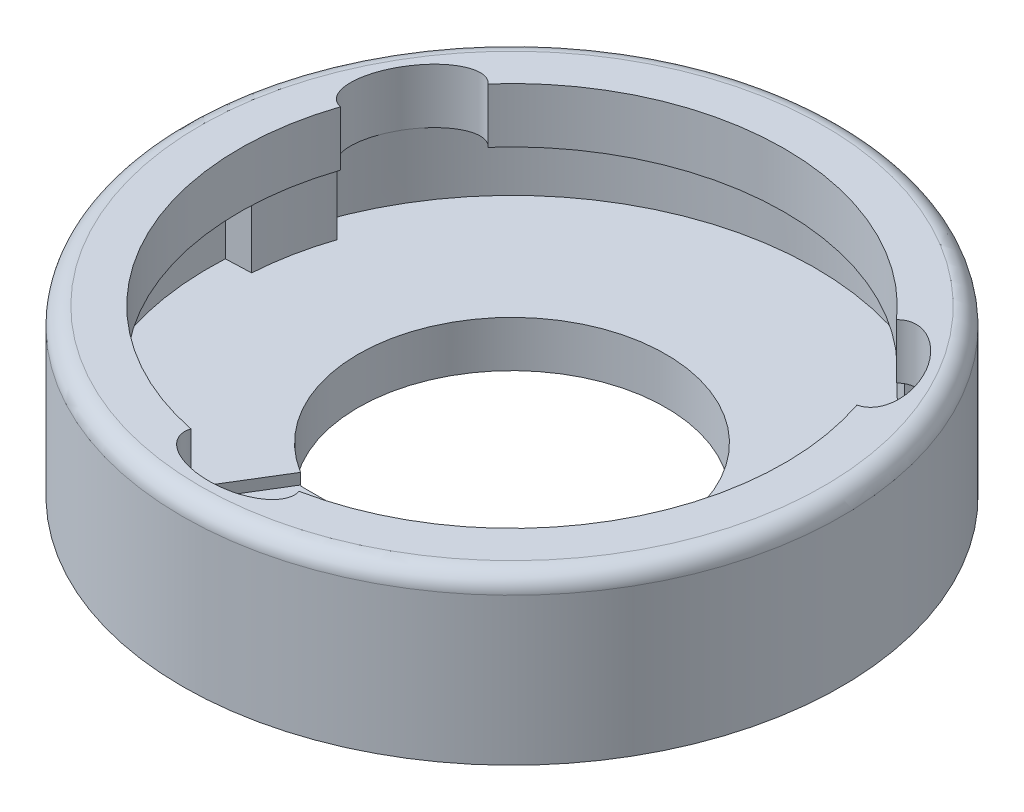
ISO-10303-21;
HEADER;
FILE_DESCRIPTION(('STEP AP214'),'2;1');
FILE_NAME('part.step','',(''),(''),'','','');
FILE_SCHEMA(('AUTOMOTIVE_DESIGN { 1 0 10303 214 1 1 1 1 }'));
ENDSEC;
DATA;
#1=APPLICATION_CONTEXT('core data for automotive mechanical design processes');
#2=APPLICATION_PROTOCOL_DEFINITION('international standard','automotive_design',2000,#1);
#3=PRODUCT_CONTEXT('',#1,'mechanical');
#4=PRODUCT('Part','Part','',(#3));
#5=PRODUCT_RELATED_PRODUCT_CATEGORY('part','',(#4));
#6=PRODUCT_DEFINITION_FORMATION('','',#4);
#7=PRODUCT_DEFINITION_CONTEXT('part definition',#1,'design');
#8=PRODUCT_DEFINITION('design','',#6,#7);
#9=PRODUCT_DEFINITION_SHAPE('','',#8);
#10=(LENGTH_UNIT() NAMED_UNIT(*) SI_UNIT(.MILLI.,.METRE.));
#11=(NAMED_UNIT(*) PLANE_ANGLE_UNIT() SI_UNIT($,.RADIAN.));
#12=(NAMED_UNIT(*) SI_UNIT($,.STERADIAN.) SOLID_ANGLE_UNIT());
#13=UNCERTAINTY_MEASURE_WITH_UNIT(LENGTH_MEASURE(1.E-05),#10,'distance_accuracy_value','');
#14=(GEOMETRIC_REPRESENTATION_CONTEXT(3) GLOBAL_UNCERTAINTY_ASSIGNED_CONTEXT((#13)) GLOBAL_UNIT_ASSIGNED_CONTEXT((#10,
#11,#12)) REPRESENTATION_CONTEXT('',''));
#15=CARTESIAN_POINT('',(0.,0.,0.));
#16=DIRECTION('',(0.,0.,1.));
#17=DIRECTION('',(1.,0.,0.));
#18=AXIS2_PLACEMENT_3D('',#15,#16,#17);
#19=CARTESIAN_POINT('',(0.,2.5,0.));
#20=DIRECTION('',(0.,-1.,0.));
#21=DIRECTION('',(0.,0.,-1.));
#22=AXIS2_PLACEMENT_3D('',#19,#20,#21);
#23=CYLINDRICAL_SURFACE('',#22,6.9);
#24=CARTESIAN_POINT('',(0.,1.05,0.));
#25=DIRECTION('',(0.,1.,0.));
#26=DIRECTION('',(0.,0.,-1.));
#27=AXIS2_PLACEMENT_3D('',#24,#25,#26);
#28=CIRCLE('',#27,6.9);
#29=CARTESIAN_POINT('',(-6.89026458179625,1.05,-0.36640686789977));
#30=VERTEX_POINT('',#29);
#31=CARTESIAN_POINT('',(-3.60125051882883,1.05,5.88566009047711));
#32=VERTEX_POINT('',#31);
#33=EDGE_CURVE('E700',#30,#32,#28,.T.);
#34=ORIENTED_EDGE('',*,*,#33,.F.);
#35=DIRECTION('',(0.,-1.,0.));
#36=VECTOR('',#35,1.);
#37=CARTESIAN_POINT('',(-6.89026458179625,2.5,-0.36640686789977));
#38=LINE('',#37,#36);
#39=CARTESIAN_POINT('',(-6.89026458179625,2.5,-0.36640686789977));
#40=VERTEX_POINT('',#39);
#41=EDGE_CURVE('E737',#30,#40,#38,.F.);
#42=ORIENTED_EDGE('',*,*,#41,.T.);
#43=CARTESIAN_POINT('',(0.,2.5,0.));
#44=DIRECTION('',(0.,1.,0.));
#45=DIRECTION('',(0.,0.,1.));
#46=AXIS2_PLACEMENT_3D('',#43,#44,#45);
#47=CIRCLE('',#46,6.9);
#48=CARTESIAN_POINT('',(0.,2.5,6.9));
#49=VERTEX_POINT('',#48);
#50=EDGE_CURVE('E302',#40,#49,#47,.T.);
#51=ORIENTED_EDGE('',*,*,#50,.T.);
#52=CARTESIAN_POINT('',(1.41322699134293,2.5,6.75372411865778));
#53=VERTEX_POINT('',#52);
#54=EDGE_CURVE('E233',#49,#53,#47,.T.);
#55=ORIENTED_EDGE('',*,*,#54,.T.);
#56=DIRECTION('',(0.,-1.,0.));
#57=VECTOR('',#56,1.);
#58=CARTESIAN_POINT('',(1.41322699134293,2.5,6.75372411865778));
#59=LINE('',#58,#57);
#60=CARTESIAN_POINT('',(1.41322699134293,0.8,6.75372411865778));
#61=VERTEX_POINT('',#60);
#62=EDGE_CURVE('E327',#53,#61,#59,.T.);
#63=ORIENTED_EDGE('',*,*,#62,.T.);
#64=CARTESIAN_POINT('',(0.,0.8,0.));
#65=DIRECTION('',(0.,1.,0.));
#66=DIRECTION('',(0.,0.,1.));
#67=AXIS2_PLACEMENT_3D('',#64,#65,#66);
#68=CIRCLE('',#67,6.9);
#69=CARTESIAN_POINT('',(-3.60125051882883,0.8,5.88566009047711));
#70=VERTEX_POINT('',#69);
#71=EDGE_CURVE('E236',#61,#70,#68,.F.);
#72=ORIENTED_EDGE('',*,*,#71,.T.);
#73=DIRECTION('',(0.,-1.,0.));
#74=VECTOR('',#73,1.);
#75=CARTESIAN_POINT('',(-3.60125051882883,1.05,5.88566009047711));
#76=LINE('',#75,#74);
#77=EDGE_CURVE('E686',#32,#70,#76,.T.);
#78=ORIENTED_EDGE('',*,*,#77,.F.);
#79=EDGE_LOOP('',(#34,#42,#51,#55,#63,#72,#78));
#80=FACE_BOUND('',#79,.T.);
#81=ADVANCED_FACE('F33',(#80),#23,.F.);
#82=CARTESIAN_POINT('',(-5.97557528611261,2.5,-3.45000000000003));
#83=VERTEX_POINT('',#82);
#84=CARTESIAN_POINT('',(-6.55551015258079,2.5,-2.152971583512));
#85=VERTEX_POINT('',#84);
#86=EDGE_CURVE('E767',#83,#85,#47,.T.);
#87=ORIENTED_EDGE('',*,*,#86,.T.);
#88=DIRECTION('',(0.,-1.,0.));
#89=VECTOR('',#88,1.);
#90=CARTESIAN_POINT('',(-6.55551015258079,2.5,-2.152971583512));
#91=LINE('',#90,#89);
#92=CARTESIAN_POINT('',(-6.55551015258079,1.05,-2.152971583512));
#93=VERTEX_POINT('',#92);
#94=EDGE_CURVE('E741',#85,#93,#91,.T.);
#95=ORIENTED_EDGE('',*,*,#94,.T.);
#96=CARTESIAN_POINT('',(3.76244994662044,1.05,-5.78394073268182));
#97=VERTEX_POINT('',#96);
#98=EDGE_CURVE('E699',#97,#93,#28,.T.);
#99=ORIENTED_EDGE('',*,*,#98,.F.);
#100=DIRECTION('',(0.,-1.,0.));
#101=VECTOR('',#100,1.);
#102=CARTESIAN_POINT('',(3.76244994662044,2.5,-5.78394073268181));
#103=LINE('',#102,#101);
#104=CARTESIAN_POINT('',(3.76244994662044,2.5,-5.78394073268181));
#105=VERTEX_POINT('',#104);
#106=EDGE_CURVE('E712',#97,#105,#103,.F.);
#107=ORIENTED_EDGE('',*,*,#106,.T.);
#108=EDGE_CURVE('E773',#105,#83,#47,.T.);
#109=ORIENTED_EDGE('',*,*,#108,.T.);
#110=EDGE_LOOP('',(#87,#95,#99,#107,#109));
#111=FACE_BOUND('',#110,.T.);
#112=ADVANCED_FACE('F350',(#111),#23,.F.);
#113=CARTESIAN_POINT('',(0.,1.05,0.));
#114=DIRECTION('',(0.,-1.,0.));
#115=DIRECTION('',(0.,0.,-1.));
#116=AXIS2_PLACEMENT_3D('',#113,#114,#115);
#117=PLANE('',#116);
#118=DIRECTION('',(0.999294785081363,0.,-0.0375490680202798));
#119=VECTOR('',#118,1.);
#120=CARTESIAN_POINT('',(-0.0234633419231046,1.05,-0.624430817075834));
#121=LINE('',#120,#119);
#122=CARTESIAN_POINT('',(-6.31283416335564,1.05,-0.388104143201012));
#123=VERTEX_POINT('',#122);
#124=EDGE_CURVE('E739',#30,#123,#121,.T.);
#125=ORIENTED_EDGE('',*,*,#124,.F.);
#126=ORIENTED_EDGE('',*,*,#33,.T.);
#127=DIRECTION('',(0.521920365047657,0.,-0.852994216011176));
#128=VECTOR('',#127,1.);
#129=CARTESIAN_POINT('',(-1.8267212776668,1.05,2.98547975603912));
#130=LINE('',#129,#128);
#131=CARTESIAN_POINT('',(-1.8267212776668,1.05,2.98547975603912));
#132=VERTEX_POINT('',#131);
#133=EDGE_CURVE('E689',#32,#132,#130,.T.);
#134=ORIENTED_EDGE('',*,*,#133,.T.);
#135=CARTESIAN_POINT('',(0.,1.05,0.));
#136=DIRECTION('',(0.,-1.,0.));
#137=DIRECTION('',(0.,0.,-1.));
#138=AXIS2_PLACEMENT_3D('',#135,#136,#137);
#139=CIRCLE('',#138,3.5);
#140=CARTESIAN_POINT('',(1.8267212776668,1.05,2.98547975603912));
#141=VERTEX_POINT('',#140);
#142=EDGE_CURVE('E692',#132,#141,#139,.T.);
#143=ORIENTED_EDGE('',*,*,#142,.T.);
#144=DIRECTION('',(0.521920365047657,0.,0.852994216011176));
#145=VECTOR('',#144,1.);
#146=CARTESIAN_POINT('',(1.8267212776668,1.05,2.98547975603912));
#147=LINE('',#146,#145);
#148=CARTESIAN_POINT('',(3.60125051882883,1.05,5.88566009047712));
#149=VERTEX_POINT('',#148);
#150=EDGE_CURVE('E701',#141,#149,#147,.T.);
#151=ORIENTED_EDGE('',*,*,#150,.T.);
#152=CARTESIAN_POINT('',(5.14228316123782,1.05,-4.60075253514574));
#153=VERTEX_POINT('',#152);
#154=EDGE_CURVE('E697',#149,#153,#28,.T.);
#155=ORIENTED_EDGE('',*,*,#154,.T.);
#156=DIRECTION('',(0.689310058131306,0.,-0.724466454543628));
#157=VECTOR('',#156,1.);
#158=CARTESIAN_POINT('',(0.401402703413376,1.05,0.381923716534586));
#159=LINE('',#158,#157);
#160=CARTESIAN_POINT('',(4.7443575034635,1.05,-4.18253175473057));
#161=VERTEX_POINT('',#160);
#162=EDGE_CURVE('E721',#161,#153,#159,.T.);
#163=ORIENTED_EDGE('',*,*,#162,.F.);
#164=CARTESIAN_POINT('',(0.,1.05,0.));
#165=DIRECTION('',(0.,-1.,0.));
#166=DIRECTION('',(0.,0.,-1.));
#167=AXIS2_PLACEMENT_3D('',#164,#165,#166);
#168=CIRCLE('',#167,6.32475295960245);
#169=CARTESIAN_POINT('',(3.49252512900392,1.05,-5.27302268374375));
#170=VERTEX_POINT('',#169);
#171=EDGE_CURVE('E255',#170,#161,#168,.T.);
#172=ORIENTED_EDGE('',*,*,#171,.F.);
#173=DIRECTION('',(-0.467128945746694,0.,0.88418920375991));
#174=VECTOR('',#173,1.);
#175=CARTESIAN_POINT('',(0.552504621455097,1.05,0.29189555837483));
#176=LINE('',#175,#174);
#177=EDGE_CURVE('E258',#97,#170,#176,.T.);
#178=ORIENTED_EDGE('',*,*,#177,.F.);
#179=ORIENTED_EDGE('',*,*,#98,.T.);
#180=DIRECTION('',(-0.972061382890081,0.,-0.234726794154021));
#181=VECTOR('',#180,1.);
#182=CARTESIAN_POINT('',(0.130054289120028,1.05,-0.538586796571027));
#183=LINE('',#182,#181);
#184=CARTESIAN_POINT('',(-5.99435750346354,1.05,-2.01746824526939));
#185=VERTEX_POINT('',#184);
#186=EDGE_CURVE('E743',#185,#93,#183,.T.);
#187=ORIENTED_EDGE('',*,*,#186,.F.);
#188=CARTESIAN_POINT('',(0.,1.05,0.));
#189=DIRECTION('',(0.,-1.,0.));
#190=DIRECTION('',(0.,0.,-1.));
#191=AXIS2_PLACEMENT_3D('',#188,#189,#190);
#192=CIRCLE('',#191,6.32475295960245);
#193=EDGE_CURVE('E54',#123,#185,#192,.T.);
#194=ORIENTED_EDGE('',*,*,#193,.F.);
#195=EDGE_LOOP('',(#125,#126,#134,#143,#151,#155,#163,#172,#178,#179,#187,#194));
#196=FACE_BOUND('',#195,.T.);
#197=ADVANCED_FACE('F540',(#196),#117,.F.);
#198=CARTESIAN_POINT('',(0.,2.5,0.));
#199=DIRECTION('',(0.,1.,0.));
#200=DIRECTION('',(0.,0.,1.));
#201=AXIS2_PLACEMENT_3D('',#198,#199,#200);
#202=PLANE('',#201);
#203=DIRECTION('',(0.999294785081363,0.,-0.0375490680202799));
#204=VECTOR('',#203,1.);
#205=CARTESIAN_POINT('',(-6.31283416335564,2.5,-0.388104143201012));
#206=LINE('',#205,#204);
#207=CARTESIAN_POINT('',(-6.31283416335564,2.5,-0.388104143201012));
#208=VERTEX_POINT('',#207);
#209=EDGE_CURVE('E209',#40,#208,#206,.T.);
#210=ORIENTED_EDGE('',*,*,#209,.T.);
#211=CARTESIAN_POINT('',(0.,2.5,0.));
#212=DIRECTION('',(0.,-1.,0.));
#213=DIRECTION('',(-0.866025403784443,0.,-0.499999999999992));
#214=AXIS2_PLACEMENT_3D('',#211,#212,#213);
#215=CIRCLE('',#214,6.32475295960245);
#216=CARTESIAN_POINT('',(-5.99435750346353,2.5,-2.01746824526939));
#217=VERTEX_POINT('',#216);
#218=EDGE_CURVE('E754',#208,#217,#215,.T.);
#219=ORIENTED_EDGE('',*,*,#218,.T.);
#220=CARTESIAN_POINT('',(-5.36935750346351,2.5,-3.10000000000003));
#221=DIRECTION('',(0.,1.,0.));
#222=DIRECTION('',(0.500000000000004,0.,-0.866025403784436));
#223=AXIS2_PLACEMENT_3D('',#220,#221,#222);
#224=ELLIPSE('',#223,1.25,0.7);
#225=CARTESIAN_POINT('',(-5.87778033262841,2.5,-1.97273879704503));
#226=VERTEX_POINT('',#225);
#227=EDGE_CURVE('E707',#217,#226,#224,.T.);
#228=ORIENTED_EDGE('',*,*,#227,.T.);
#229=CARTESIAN_POINT('',(0.,2.5,0.));
#230=DIRECTION('',(0.,1.,0.));
#231=DIRECTION('',(0.,0.,1.));
#232=AXIS2_PLACEMENT_3D('',#229,#230,#231);
#233=CIRCLE('',#232,6.2);
#234=CARTESIAN_POINT('',(-1.23044825304208,2.5,6.07667648444326));
#235=VERTEX_POINT('',#234);
#236=EDGE_CURVE('E309',#226,#235,#233,.T.);
#237=ORIENTED_EDGE('',*,*,#236,.T.);
#238=CARTESIAN_POINT('',(0.,2.5,6.2));
#239=DIRECTION('',(0.,1.,0.));
#240=DIRECTION('',(-1.,0.,0.));
#241=AXIS2_PLACEMENT_3D('',#238,#239,#240);
#242=ELLIPSE('',#241,1.25,0.7);
#243=EDGE_CURVE('E313',#235,#49,#242,.T.);
#244=ORIENTED_EDGE('',*,*,#243,.T.);
#245=ORIENTED_EDGE('',*,*,#50,.F.);
#246=EDGE_LOOP('',(#210,#219,#228,#237,#244,#245));
#247=FACE_BOUND('',#246,.T.);
#248=ADVANCED_FACE('F347',(#247),#202,.F.);
#249=DIRECTION('',(-0.972061382890081,0.,-0.234726794154021));
#250=VECTOR('',#249,1.);
#251=CARTESIAN_POINT('',(-5.99435750346353,2.5,-2.01746824526939));
#252=LINE('',#251,#250);
#253=EDGE_CURVE('E752',#217,#85,#252,.T.);
#254=ORIENTED_EDGE('',*,*,#253,.T.);
#255=ORIENTED_EDGE('',*,*,#86,.F.);
#256=EDGE_CURVE('E705',#83,#217,#224,.T.);
#257=ORIENTED_EDGE('',*,*,#256,.T.);
#258=EDGE_LOOP('',(#254,#255,#257));
#259=FACE_BOUND('',#258,.T.);
#260=ADVANCED_FACE('F555',(#259),#202,.F.);
#261=DIRECTION('',(-0.467128945746694,0.,0.88418920375991));
#262=VECTOR('',#261,1.);
#263=CARTESIAN_POINT('',(3.49252512900392,2.5,-5.27302268374375));
#264=LINE('',#263,#262);
#265=CARTESIAN_POINT('',(3.49252512900392,2.5,-5.27302268374375));
#266=VERTEX_POINT('',#265);
#267=EDGE_CURVE('E734',#105,#266,#264,.T.);
#268=ORIENTED_EDGE('',*,*,#267,.T.);
#269=CARTESIAN_POINT('',(0.,2.5,0.));
#270=DIRECTION('',(0.,-1.,0.));
#271=DIRECTION('',(0.866025403784436,0.,-0.500000000000004));
#272=AXIS2_PLACEMENT_3D('',#269,#270,#271);
#273=CIRCLE('',#272,6.32475295960245);
#274=CARTESIAN_POINT('',(4.74435750346329,2.5,-4.18253175473035));
#275=VERTEX_POINT('',#274);
#276=EDGE_CURVE('E732',#266,#275,#273,.T.);
#277=ORIENTED_EDGE('',*,*,#276,.T.);
#278=CARTESIAN_POINT('',(5.36935750346355,2.5,-3.09999999999995));
#279=DIRECTION('',(0.,1.,0.));
#280=DIRECTION('',(0.499999999999992,0.,0.866025403784443));
#281=AXIS2_PLACEMENT_3D('',#278,#279,#280);
#282=ELLIPSE('',#281,1.25,0.7);
#283=CARTESIAN_POINT('',(4.64733207958637,2.5,-4.10393768739821));
#284=VERTEX_POINT('',#283);
#285=EDGE_CURVE('E709',#275,#284,#282,.T.);
#286=ORIENTED_EDGE('',*,*,#285,.T.);
#287=CARTESIAN_POINT('',(-4.64733207958632,2.5,-4.10393768739827));
#288=VERTEX_POINT('',#287);
#289=EDGE_CURVE('E308',#284,#288,#233,.T.);
#290=ORIENTED_EDGE('',*,*,#289,.T.);
#291=EDGE_CURVE('E695',#288,#83,#224,.T.);
#292=ORIENTED_EDGE('',*,*,#291,.T.);
#293=ORIENTED_EDGE('',*,*,#108,.F.);
#294=EDGE_LOOP('',(#268,#277,#286,#290,#292,#293));
#295=FACE_BOUND('',#294,.T.);
#296=ADVANCED_FACE('F562',(#295),#202,.F.);
#297=DIRECTION('',(0.689310058131307,0.,-0.724466454543628));
#298=VECTOR('',#297,1.);
#299=CARTESIAN_POINT('',(4.7443575034635,2.5,-4.18253175473057));
#300=LINE('',#299,#298);
#301=CARTESIAN_POINT('',(5.14228316123782,2.5,-4.60075253514574));
#302=VERTEX_POINT('',#301);
#303=EDGE_CURVE('E730',#275,#302,#300,.T.);
#304=ORIENTED_EDGE('',*,*,#303,.T.);
#305=CARTESIAN_POINT('',(5.97557528611266,2.5,-3.44999999999994));
#306=VERTEX_POINT('',#305);
#307=EDGE_CURVE('E774',#306,#302,#47,.T.);
#308=ORIENTED_EDGE('',*,*,#307,.F.);
#309=EDGE_CURVE('E710',#306,#275,#282,.T.);
#310=ORIENTED_EDGE('',*,*,#309,.T.);
#311=EDGE_LOOP('',(#304,#308,#310));
#312=FACE_BOUND('',#311,.T.);
#313=ADVANCED_FACE('F570',(#312),#202,.F.);
#314=ORIENTED_EDGE('',*,*,#307,.T.);
#315=DIRECTION('',(0.,-1.,0.));
#316=VECTOR('',#315,1.);
#317=CARTESIAN_POINT('',(5.14228316123782,2.5,-4.60075253514574));
#318=LINE('',#317,#316);
#319=EDGE_CURVE('E718',#302,#153,#318,.T.);
#320=ORIENTED_EDGE('',*,*,#319,.T.);
#321=ORIENTED_EDGE('',*,*,#154,.F.);
#322=DIRECTION('',(0.,-1.,0.));
#323=VECTOR('',#322,1.);
#324=CARTESIAN_POINT('',(3.60125051882883,1.05,5.88566009047712));
#325=LINE('',#324,#323);
#326=CARTESIAN_POINT('',(3.60125051882883,0.8,5.88566009047712));
#327=VERTEX_POINT('',#326);
#328=EDGE_CURVE('E683',#149,#327,#325,.T.);
#329=ORIENTED_EDGE('',*,*,#328,.T.);
#330=CARTESIAN_POINT('',(3.12781463517578,0.8,6.15034760058163));
#331=VERTEX_POINT('',#330);
#332=EDGE_CURVE('E228',#327,#331,#68,.F.);
#333=ORIENTED_EDGE('',*,*,#332,.T.);
#334=DIRECTION('',(0.,-1.,0.));
#335=VECTOR('',#334,1.);
#336=CARTESIAN_POINT('',(3.12781463517578,2.5,6.15034760058163));
#337=LINE('',#336,#335);
#338=CARTESIAN_POINT('',(3.12781463517578,2.5,6.15034760058163));
#339=VERTEX_POINT('',#338);
#340=EDGE_CURVE('E324',#331,#339,#337,.F.);
#341=ORIENTED_EDGE('',*,*,#340,.T.);
#342=EDGE_CURVE('E662',#339,#306,#47,.T.);
#343=ORIENTED_EDGE('',*,*,#342,.T.);
#344=EDGE_LOOP('',(#314,#320,#321,#329,#333,#341,#343));
#345=FACE_BOUND('',#344,.T.);
#346=ADVANCED_FACE('F352',(#345),#23,.F.);
#347=CARTESIAN_POINT('',(0.,3.75,0.));
#348=DIRECTION('',(0.,-1.,0.));
#349=DIRECTION('',(0.,0.,-1.));
#350=AXIS2_PLACEMENT_3D('',#347,#348,#349);
#351=CYLINDRICAL_SURFACE('',#350,6.2);
#352=DIRECTION('',(0.,1.,0.));
#353=VECTOR('',#352,1.);
#354=CARTESIAN_POINT('',(-4.64733207958632,2.,-4.10393768739827));
#355=LINE('',#354,#353);
#356=CARTESIAN_POINT('',(-4.64733207958632,3.75,-4.10393768739828));
#357=VERTEX_POINT('',#356);
#358=EDGE_CURVE('E253',#288,#357,#355,.T.);
#359=ORIENTED_EDGE('',*,*,#358,.F.);
#360=ORIENTED_EDGE('',*,*,#289,.F.);
#361=DIRECTION('',(0.,1.,0.));
#362=VECTOR('',#361,1.);
#363=CARTESIAN_POINT('',(4.64733207958638,2.,-4.10393768739821));
#364=LINE('',#363,#362);
#365=CARTESIAN_POINT('',(4.64733207958637,3.75,-4.10393768739821));
#366=VERTEX_POINT('',#365);
#367=EDGE_CURVE('E247',#366,#284,#364,.F.);
#368=ORIENTED_EDGE('',*,*,#367,.F.);
#369=CARTESIAN_POINT('',(0.,3.75,0.));
#370=DIRECTION('',(0.,1.,0.));
#371=DIRECTION('',(0.,0.,1.));
#372=AXIS2_PLACEMENT_3D('',#369,#370,#371);
#373=CIRCLE('',#372,6.2);
#374=EDGE_CURVE('E285',#366,#357,#373,.T.);
#375=ORIENTED_EDGE('',*,*,#374,.T.);
#376=EDGE_LOOP('',(#359,#360,#368,#375));
#377=FACE_BOUND('',#376,.T.);
#378=ADVANCED_FACE('F296',(#377),#351,.F.);
#379=DIRECTION('',(0.,1.,0.));
#380=VECTOR('',#379,1.);
#381=CARTESIAN_POINT('',(-5.87778033262841,2.,-1.97273879704503));
#382=LINE('',#381,#380);
#383=CARTESIAN_POINT('',(-5.87778033262841,3.75,-1.97273879704503));
#384=VERTEX_POINT('',#383);
#385=EDGE_CURVE('E250',#384,#226,#382,.F.);
#386=ORIENTED_EDGE('',*,*,#385,.F.);
#387=CARTESIAN_POINT('',(-1.23044825304208,3.75,6.07667648444326));
#388=VERTEX_POINT('',#387);
#389=EDGE_CURVE('E287',#384,#388,#373,.T.);
#390=ORIENTED_EDGE('',*,*,#389,.T.);
#391=DIRECTION('',(0.,1.,0.));
#392=VECTOR('',#391,1.);
#393=CARTESIAN_POINT('',(-1.23044825304208,2.,6.07667648444326));
#394=LINE('',#393,#392);
#395=EDGE_CURVE('E242',#235,#388,#394,.T.);
#396=ORIENTED_EDGE('',*,*,#395,.F.);
#397=ORIENTED_EDGE('',*,*,#236,.F.);
#398=EDGE_LOOP('',(#386,#390,#396,#397));
#399=FACE_BOUND('',#398,.T.);
#400=ADVANCED_FACE('F341',(#399),#351,.F.);
#401=CARTESIAN_POINT('',(0.,0.8,0.));
#402=DIRECTION('',(0.,1.,0.));
#403=DIRECTION('',(0.,0.,1.));
#404=AXIS2_PLACEMENT_3D('',#401,#402,#403);
#405=PLANE('',#404);
#406=DIRECTION('',(1.,0.,0.));
#407=VECTOR('',#406,1.);
#408=CARTESIAN_POINT('',(-1.79594287420957,0.8,3.00409540337451));
#409=LINE('',#408,#407);
#410=CARTESIAN_POINT('',(-1.79594287420957,0.8,3.00409540337451));
#411=VERTEX_POINT('',#410);
#412=CARTESIAN_POINT('',(1.79594287420957,0.8,3.00409540337451));
#413=VERTEX_POINT('',#412);
#414=EDGE_CURVE('E204',#411,#413,#409,.T.);
#415=ORIENTED_EDGE('',*,*,#414,.F.);
#416=CARTESIAN_POINT('',(0.,0.8,0.));
#417=DIRECTION('',(0.,1.,0.));
#418=DIRECTION('',(0.,0.,1.));
#419=AXIS2_PLACEMENT_3D('',#416,#417,#418);
#420=CIRCLE('',#419,3.5);
#421=CARTESIAN_POINT('',(-1.8267212776668,0.8,2.98547975603912));
#422=VERTEX_POINT('',#421);
#423=EDGE_CURVE('E216',#422,#411,#420,.T.);
#424=ORIENTED_EDGE('',*,*,#423,.F.);
#425=DIRECTION('',(0.521920365047657,0.,-0.852994216011176));
#426=VECTOR('',#425,1.);
#427=CARTESIAN_POINT('',(-1.8267212776668,0.8,2.98547975603912));
#428=LINE('',#427,#426);
#429=EDGE_CURVE('E690',#70,#422,#428,.T.);
#430=ORIENTED_EDGE('',*,*,#429,.F.);
#431=ORIENTED_EDGE('',*,*,#71,.F.);
#432=DIRECTION('',(0.282751324758769,0.,0.959193248697655));
#433=VECTOR('',#432,1.);
#434=CARTESIAN_POINT('',(1.25,0.8,6.2));
#435=LINE('',#434,#433);
#436=CARTESIAN_POINT('',(1.25,0.8,6.2));
#437=VERTEX_POINT('',#436);
#438=EDGE_CURVE('E664',#437,#61,#435,.T.);
#439=ORIENTED_EDGE('',*,*,#438,.F.);
#440=CARTESIAN_POINT('',(0.,0.8,0.));
#441=DIRECTION('',(0.,-1.,0.));
#442=DIRECTION('',(0.,0.,1.));
#443=AXIS2_PLACEMENT_3D('',#440,#441,#442);
#444=CIRCLE('',#443,6.32475295960245);
#445=CARTESIAN_POINT('',(2.8203090343517,0.8,5.6611268269448));
#446=VERTEX_POINT('',#445);
#447=EDGE_CURVE('E672',#446,#437,#444,.T.);
#448=ORIENTED_EDGE('',*,*,#447,.F.);
#449=DIRECTION('',(-0.532165839334666,0.,-0.846640135739637));
#450=VECTOR('',#449,1.);
#451=CARTESIAN_POINT('',(2.8203090343517,0.8,5.6611268269448));
#452=LINE('',#451,#450);
#453=EDGE_CURVE('E675',#331,#446,#452,.T.);
#454=ORIENTED_EDGE('',*,*,#453,.F.);
#455=ORIENTED_EDGE('',*,*,#332,.F.);
#456=DIRECTION('',(0.521920365047657,0.,0.852994216011176));
#457=VECTOR('',#456,1.);
#458=CARTESIAN_POINT('',(1.8267212776668,0.8,2.98547975603912));
#459=LINE('',#458,#457);
#460=CARTESIAN_POINT('',(1.8267212776668,0.8,2.98547975603912));
#461=VERTEX_POINT('',#460);
#462=EDGE_CURVE('E693',#461,#327,#459,.T.);
#463=ORIENTED_EDGE('',*,*,#462,.F.);
#464=EDGE_CURVE('E218',#413,#461,#420,.T.);
#465=ORIENTED_EDGE('',*,*,#464,.F.);
#466=EDGE_LOOP('',(#415,#424,#430,#431,#439,#448,#454,#455,#463,#465));
#467=FACE_BOUND('',#466,.T.);
#468=ADVANCED_FACE('F214',(#467),#405,.T.);
#469=CARTESIAN_POINT('',(1.23044825304208,2.5,6.07667648444326));
#470=VERTEX_POINT('',#469);
#471=CARTESIAN_POINT('',(5.87778033262844,2.5,-1.97273879704495));
#472=VERTEX_POINT('',#471);
#473=EDGE_CURVE('E303',#470,#472,#233,.T.);
#474=ORIENTED_EDGE('',*,*,#473,.T.);
#475=EDGE_CURVE('E290',#472,#306,#282,.T.);
#476=ORIENTED_EDGE('',*,*,#475,.T.);
#477=ORIENTED_EDGE('',*,*,#342,.F.);
#478=DIRECTION('',(-0.532165839334666,0.,-0.846640135739637));
#479=VECTOR('',#478,1.);
#480=CARTESIAN_POINT('',(2.8203090343517,2.5,5.6611268269448));
#481=LINE('',#480,#479);
#482=CARTESIAN_POINT('',(2.8203090343517,2.5,5.6611268269448));
#483=VERTEX_POINT('',#482);
#484=EDGE_CURVE('E671',#339,#483,#481,.T.);
#485=ORIENTED_EDGE('',*,*,#484,.T.);
#486=CARTESIAN_POINT('',(0.,2.5,0.));
#487=DIRECTION('',(0.,-1.,0.));
#488=DIRECTION('',(0.,0.,1.));
#489=AXIS2_PLACEMENT_3D('',#486,#487,#488);
#490=CIRCLE('',#489,6.32475295960245);
#491=CARTESIAN_POINT('',(1.25,2.5,6.2));
#492=VERTEX_POINT('',#491);
#493=EDGE_CURVE('E658',#483,#492,#490,.T.);
#494=ORIENTED_EDGE('',*,*,#493,.T.);
#495=EDGE_CURVE('E318',#492,#470,#242,.T.);
#496=ORIENTED_EDGE('',*,*,#495,.T.);
#497=EDGE_LOOP('',(#474,#476,#477,#485,#494,#496));
#498=FACE_BOUND('',#497,.T.);
#499=ADVANCED_FACE('F343',(#498),#202,.F.);
#500=DIRECTION('',(0.282751324758769,0.,0.959193248697655));
#501=VECTOR('',#500,1.);
#502=CARTESIAN_POINT('',(1.25,2.5,6.2));
#503=LINE('',#502,#501);
#504=EDGE_CURVE('E652',#492,#53,#503,.T.);
#505=ORIENTED_EDGE('',*,*,#504,.T.);
#506=ORIENTED_EDGE('',*,*,#54,.F.);
#507=EDGE_CURVE('E305',#49,#492,#242,.T.);
#508=ORIENTED_EDGE('',*,*,#507,.T.);
#509=EDGE_LOOP('',(#505,#506,#508));
#510=FACE_BOUND('',#509,.T.);
#511=ADVANCED_FACE('F346',(#510),#202,.F.);
#512=CARTESIAN_POINT('',(0.,0.,0.));
#513=DIRECTION('',(0.,1.,0.));
#514=DIRECTION('',(0.,0.,1.));
#515=AXIS2_PLACEMENT_3D('',#512,#513,#514);
#516=PLANE('',#515);
#517=CARTESIAN_POINT('',(0.,0.,0.));
#518=DIRECTION('',(0.,1.,0.));
#519=DIRECTION('',(0.,0.,1.));
#520=AXIS2_PLACEMENT_3D('',#517,#518,#519);
#521=CIRCLE('',#520,7.5);
#522=CARTESIAN_POINT('',(0.,0.,7.5));
#523=VERTEX_POINT('',#522);
#524=EDGE_CURVE('E225',#523,#523,#521,.T.);
#525=ORIENTED_EDGE('',*,*,#524,.F.);
#526=EDGE_LOOP('',(#525));
#527=FACE_BOUND('',#526,.T.);
#528=CARTESIAN_POINT('',(0.,0.,0.));
#529=DIRECTION('',(0.,1.,0.));
#530=DIRECTION('',(0.,0.,1.));
#531=AXIS2_PLACEMENT_3D('',#528,#529,#530);
#532=CIRCLE('',#531,3.5);
#533=CARTESIAN_POINT('',(1.79594287420957,0.,3.00409540337451));
#534=VERTEX_POINT('',#533);
#535=CARTESIAN_POINT('',(-1.79594287420957,0.,3.00409540337451));
#536=VERTEX_POINT('',#535);
#537=EDGE_CURVE('E230',#534,#536,#532,.T.);
#538=ORIENTED_EDGE('',*,*,#537,.T.);
#539=DIRECTION('',(1.,0.,0.));
#540=VECTOR('',#539,1.);
#541=CARTESIAN_POINT('',(-1.79594287420957,0.,3.00409540337451));
#542=LINE('',#541,#540);
#543=EDGE_CURVE('E47',#536,#534,#542,.T.);
#544=ORIENTED_EDGE('',*,*,#543,.T.);
#545=EDGE_LOOP('',(#538,#544));
#546=FACE_BOUND('',#545,.T.);
#547=ADVANCED_FACE('F357',(#527,#546),#516,.F.);
#548=CARTESIAN_POINT('',(0.,0.8,0.));
#549=DIRECTION('',(0.,-1.,0.));
#550=DIRECTION('',(0.,0.,-1.));
#551=AXIS2_PLACEMENT_3D('',#548,#549,#550);
#552=CYLINDRICAL_SURFACE('',#551,7.5);
#553=CARTESIAN_POINT('',(0.,3.35,0.));
#554=DIRECTION('',(0.,1.,0.));
#555=DIRECTION('',(0.,0.,1.));
#556=AXIS2_PLACEMENT_3D('',#553,#554,#555);
#557=CIRCLE('',#556,7.5);
#558=CARTESIAN_POINT('',(0.,3.35,7.5));
#559=VERTEX_POINT('',#558);
#560=EDGE_CURVE('E41',#559,#559,#557,.F.);
#561=ORIENTED_EDGE('',*,*,#560,.T.);
#562=EDGE_LOOP('',(#561));
#563=FACE_BOUND('',#562,.T.);
#564=ORIENTED_EDGE('',*,*,#524,.T.);
#565=EDGE_LOOP('',(#564));
#566=FACE_BOUND('',#565,.T.);
#567=ADVANCED_FACE('F266',(#563,#566),#552,.T.);
#568=CARTESIAN_POINT('',(0.,0.8,0.));
#569=DIRECTION('',(0.,-1.,0.));
#570=DIRECTION('',(0.,0.,-1.));
#571=AXIS2_PLACEMENT_3D('',#568,#569,#570);
#572=CYLINDRICAL_SURFACE('',#571,3.5);
#573=DIRECTION('',(0.,-1.,0.));
#574=VECTOR('',#573,1.);
#575=CARTESIAN_POINT('',(1.79594287420957,0.8,3.00409540337451));
#576=LINE('',#575,#574);
#577=EDGE_CURVE('E11',#413,#534,#576,.T.);
#578=ORIENTED_EDGE('',*,*,#577,.F.);
#579=ORIENTED_EDGE('',*,*,#464,.T.);
#580=DIRECTION('',(0.,-1.,0.));
#581=VECTOR('',#580,1.);
#582=CARTESIAN_POINT('',(1.8267212776668,1.05,2.98547975603912));
#583=LINE('',#582,#581);
#584=EDGE_CURVE('E677',#141,#461,#583,.T.);
#585=ORIENTED_EDGE('',*,*,#584,.F.);
#586=ORIENTED_EDGE('',*,*,#142,.F.);
#587=DIRECTION('',(0.,-1.,0.));
#588=VECTOR('',#587,1.);
#589=CARTESIAN_POINT('',(-1.8267212776668,1.05,2.98547975603912));
#590=LINE('',#589,#588);
#591=EDGE_CURVE('E223',#132,#422,#590,.T.);
#592=ORIENTED_EDGE('',*,*,#591,.T.);
#593=ORIENTED_EDGE('',*,*,#423,.T.);
#594=DIRECTION('',(0.,-1.,0.));
#595=VECTOR('',#594,1.);
#596=CARTESIAN_POINT('',(-1.79594287420957,0.8,3.00409540337451));
#597=LINE('',#596,#595);
#598=EDGE_CURVE('E201',#411,#536,#597,.T.);
#599=ORIENTED_EDGE('',*,*,#598,.T.);
#600=ORIENTED_EDGE('',*,*,#537,.F.);
#601=EDGE_LOOP('',(#578,#579,#585,#586,#592,#593,#599,#600));
#602=FACE_BOUND('',#601,.T.);
#603=ADVANCED_FACE('F220',(#602),#572,.F.);
#604=CARTESIAN_POINT('',(0.,3.75,0.));
#605=DIRECTION('',(0.,1.,0.));
#606=DIRECTION('',(0.,0.,1.));
#607=AXIS2_PLACEMENT_3D('',#604,#605,#606);
#608=PLANE('',#607);
#609=CARTESIAN_POINT('',(0.,3.75,0.));
#610=DIRECTION('',(0.,1.,0.));
#611=DIRECTION('',(0.,0.,1.));
#612=AXIS2_PLACEMENT_3D('',#609,#610,#611);
#613=CIRCLE('',#612,7.1);
#614=CARTESIAN_POINT('',(0.,3.75,7.1));
#615=VERTEX_POINT('',#614);
#616=EDGE_CURVE('E261',#615,#615,#613,.T.);
#617=ORIENTED_EDGE('',*,*,#616,.T.);
#618=EDGE_LOOP('',(#617));
#619=FACE_BOUND('',#618,.T.);
#620=CARTESIAN_POINT('',(-5.36935750346351,3.75,-3.10000000000003));
#621=DIRECTION('',(0.,1.,0.));
#622=DIRECTION('',(0.500000000000004,0.,-0.866025403784436));
#623=AXIS2_PLACEMENT_3D('',#620,#621,#622);
#624=ELLIPSE('',#623,1.25,0.7);
#625=EDGE_CURVE('E282',#357,#384,#624,.T.);
#626=ORIENTED_EDGE('',*,*,#625,.F.);
#627=ORIENTED_EDGE('',*,*,#374,.F.);
#628=CARTESIAN_POINT('',(5.36935750346355,3.75,-3.09999999999995));
#629=DIRECTION('',(0.,1.,0.));
#630=DIRECTION('',(0.499999999999992,0.,0.866025403784443));
#631=AXIS2_PLACEMENT_3D('',#628,#629,#630);
#632=ELLIPSE('',#631,1.25,0.7);
#633=CARTESIAN_POINT('',(5.87778033262843,3.75,-1.97273879704495));
#634=VERTEX_POINT('',#633);
#635=EDGE_CURVE('E291',#634,#366,#632,.T.);
#636=ORIENTED_EDGE('',*,*,#635,.F.);
#637=CARTESIAN_POINT('',(1.23044825304208,3.75,6.07667648444326));
#638=VERTEX_POINT('',#637);
#639=EDGE_CURVE('E299',#638,#634,#373,.T.);
#640=ORIENTED_EDGE('',*,*,#639,.F.);
#641=CARTESIAN_POINT('',(0.,3.75,6.2));
#642=DIRECTION('',(0.,1.,0.));
#643=DIRECTION('',(-1.,0.,0.));
#644=AXIS2_PLACEMENT_3D('',#641,#642,#643);
#645=ELLIPSE('',#644,1.25,0.7);
#646=EDGE_CURVE('E321',#388,#638,#645,.T.);
#647=ORIENTED_EDGE('',*,*,#646,.F.);
#648=ORIENTED_EDGE('',*,*,#389,.F.);
#649=EDGE_LOOP('',(#626,#627,#636,#640,#647,#648));
#650=FACE_BOUND('',#649,.T.);
#651=ADVANCED_FACE('F274',(#619,#650),#608,.T.);
#652=DIRECTION('',(0.,1.,0.));
#653=VECTOR('',#652,1.);
#654=CARTESIAN_POINT('',(5.87778033262844,2.,-1.97273879704495));
#655=LINE('',#654,#653);
#656=EDGE_CURVE('E245',#472,#634,#655,.T.);
#657=ORIENTED_EDGE('',*,*,#656,.F.);
#658=ORIENTED_EDGE('',*,*,#473,.F.);
#659=DIRECTION('',(0.,1.,0.));
#660=VECTOR('',#659,1.);
#661=CARTESIAN_POINT('',(1.23044825304208,2.,6.07667648444326));
#662=LINE('',#661,#660);
#663=EDGE_CURVE('E239',#638,#470,#662,.F.);
#664=ORIENTED_EDGE('',*,*,#663,.F.);
#665=ORIENTED_EDGE('',*,*,#639,.T.);
#666=EDGE_LOOP('',(#657,#658,#664,#665));
#667=FACE_BOUND('',#666,.T.);
#668=ADVANCED_FACE('F277',(#667),#351,.F.);
#669=CARTESIAN_POINT('',(0.,2.,6.2));
#670=DIRECTION('',(0.,1.,0.));
#671=DIRECTION('',(-1.,0.,0.));
#672=AXIS2_PLACEMENT_3D('',#669,#670,#671);
#673=ELLIPSE('',#672,1.25,0.7);
#674=DIRECTION('',(0.,1.,0.));
#675=VECTOR('',#674,1.);
#676=SURFACE_OF_LINEAR_EXTRUSION('',#673,#675);
#677=ORIENTED_EDGE('',*,*,#395,.T.);
#678=ORIENTED_EDGE('',*,*,#646,.T.);
#679=ORIENTED_EDGE('',*,*,#663,.T.);
#680=ORIENTED_EDGE('',*,*,#495,.F.);
#681=ORIENTED_EDGE('',*,*,#507,.F.);
#682=ORIENTED_EDGE('',*,*,#243,.F.);
#683=EDGE_LOOP('',(#677,#678,#679,#680,#681,#682));
#684=FACE_BOUND('',#683,.T.);
#685=ADVANCED_FACE('F333',(#684),#676,.F.);
#686=CARTESIAN_POINT('',(2.8203090343517,2.5,5.6611268269448));
#687=DIRECTION('',(-0.846640135739637,0.,0.532165839334666));
#688=DIRECTION('',(0.532165839334666,0.,0.846640135739637));
#689=AXIS2_PLACEMENT_3D('',#686,#687,#688);
#690=PLANE('',#689);
#691=ORIENTED_EDGE('',*,*,#340,.F.);
#692=ORIENTED_EDGE('',*,*,#453,.T.);
#693=DIRECTION('',(0.,-1.,0.));
#694=VECTOR('',#693,1.);
#695=CARTESIAN_POINT('',(2.8203090343517,2.5,5.6611268269448));
#696=LINE('',#695,#694);
#697=EDGE_CURVE('E665',#483,#446,#696,.T.);
#698=ORIENTED_EDGE('',*,*,#697,.F.);
#699=ORIENTED_EDGE('',*,*,#484,.F.);
#700=EDGE_LOOP('',(#691,#692,#698,#699));
#701=FACE_BOUND('',#700,.T.);
#702=ADVANCED_FACE('F337',(#701),#690,.F.);
#703=CARTESIAN_POINT('',(0.,2.5,0.));
#704=DIRECTION('',(0.,-1.,0.));
#705=DIRECTION('',(0.,0.,-1.));
#706=AXIS2_PLACEMENT_3D('',#703,#704,#705);
#707=CYLINDRICAL_SURFACE('',#706,6.32475295960245);
#708=ORIENTED_EDGE('',*,*,#447,.T.);
#709=DIRECTION('',(0.,-1.,0.));
#710=VECTOR('',#709,1.);
#711=CARTESIAN_POINT('',(1.25,2.5,6.2));
#712=LINE('',#711,#710);
#713=EDGE_CURVE('E657',#492,#437,#712,.T.);
#714=ORIENTED_EDGE('',*,*,#713,.F.);
#715=ORIENTED_EDGE('',*,*,#493,.F.);
#716=ORIENTED_EDGE('',*,*,#697,.T.);
#717=EDGE_LOOP('',(#708,#714,#715,#716));
#718=FACE_BOUND('',#717,.T.);
#719=ADVANCED_FACE('F394',(#718),#707,.F.);
#720=CARTESIAN_POINT('',(1.25,2.5,6.2));
#721=DIRECTION('',(0.959193248697655,0.,-0.282751324758769));
#722=DIRECTION('',(-0.282751324758769,0.,-0.959193248697655));
#723=AXIS2_PLACEMENT_3D('',#720,#721,#722);
#724=PLANE('',#723);
#725=ORIENTED_EDGE('',*,*,#62,.F.);
#726=ORIENTED_EDGE('',*,*,#504,.F.);
#727=ORIENTED_EDGE('',*,*,#713,.T.);
#728=ORIENTED_EDGE('',*,*,#438,.T.);
#729=EDGE_LOOP('',(#725,#726,#727,#728));
#730=FACE_BOUND('',#729,.T.);
#731=ADVANCED_FACE('F401',(#730),#724,.F.);
#732=CARTESIAN_POINT('',(1.8267212776668,1.05,2.98547975603912));
#733=DIRECTION('',(0.852994216011176,0.,-0.521920365047657));
#734=DIRECTION('',(-0.521920365047657,0.,-0.852994216011176));
#735=AXIS2_PLACEMENT_3D('',#732,#733,#734);
#736=PLANE('',#735);
#737=ORIENTED_EDGE('',*,*,#462,.T.);
#738=ORIENTED_EDGE('',*,*,#328,.F.);
#739=ORIENTED_EDGE('',*,*,#150,.F.);
#740=ORIENTED_EDGE('',*,*,#584,.T.);
#741=EDGE_LOOP('',(#737,#738,#739,#740));
#742=FACE_BOUND('',#741,.T.);
#743=ADVANCED_FACE('F408',(#742),#736,.F.);
#744=CARTESIAN_POINT('',(-1.8267212776668,1.05,2.98547975603912));
#745=DIRECTION('',(-0.852994216011176,0.,-0.521920365047657));
#746=DIRECTION('',(-0.521920365047657,0.,0.852994216011176));
#747=AXIS2_PLACEMENT_3D('',#744,#745,#746);
#748=PLANE('',#747);
#749=ORIENTED_EDGE('',*,*,#429,.T.);
#750=ORIENTED_EDGE('',*,*,#591,.F.);
#751=ORIENTED_EDGE('',*,*,#133,.F.);
#752=ORIENTED_EDGE('',*,*,#77,.T.);
#753=EDGE_LOOP('',(#749,#750,#751,#752));
#754=FACE_BOUND('',#753,.T.);
#755=ADVANCED_FACE('F416',(#754),#748,.F.);
#756=CARTESIAN_POINT('',(5.36935750346355,2.,-3.09999999999995));
#757=DIRECTION('',(0.,1.,0.));
#758=DIRECTION('',(0.499999999999992,0.,0.866025403784443));
#759=AXIS2_PLACEMENT_3D('',#756,#757,#758);
#760=ELLIPSE('',#759,1.25,0.7);
#761=DIRECTION('',(0.,1.,0.));
#762=VECTOR('',#761,1.);
#763=SURFACE_OF_LINEAR_EXTRUSION('',#760,#762);
#764=ORIENTED_EDGE('',*,*,#367,.T.);
#765=ORIENTED_EDGE('',*,*,#285,.F.);
#766=ORIENTED_EDGE('',*,*,#309,.F.);
#767=ORIENTED_EDGE('',*,*,#475,.F.);
#768=ORIENTED_EDGE('',*,*,#656,.T.);
#769=ORIENTED_EDGE('',*,*,#635,.T.);
#770=EDGE_LOOP('',(#764,#765,#766,#767,#768,#769));
#771=FACE_BOUND('',#770,.T.);
#772=ADVANCED_FACE('F424',(#771),#763,.F.);
#773=CARTESIAN_POINT('',(-5.36935750346351,2.,-3.10000000000003));
#774=DIRECTION('',(0.,1.,0.));
#775=DIRECTION('',(0.500000000000004,0.,-0.866025403784436));
#776=AXIS2_PLACEMENT_3D('',#773,#774,#775);
#777=ELLIPSE('',#776,1.25,0.7);
#778=DIRECTION('',(0.,1.,0.));
#779=VECTOR('',#778,1.);
#780=SURFACE_OF_LINEAR_EXTRUSION('',#777,#779);
#781=ORIENTED_EDGE('',*,*,#358,.T.);
#782=ORIENTED_EDGE('',*,*,#625,.T.);
#783=ORIENTED_EDGE('',*,*,#385,.T.);
#784=ORIENTED_EDGE('',*,*,#227,.F.);
#785=ORIENTED_EDGE('',*,*,#256,.F.);
#786=ORIENTED_EDGE('',*,*,#291,.F.);
#787=EDGE_LOOP('',(#781,#782,#783,#784,#785,#786));
#788=FACE_BOUND('',#787,.T.);
#789=ADVANCED_FACE('F433',(#788),#780,.F.);
#790=CARTESIAN_POINT('',(0.,2.5,0.));
#791=DIRECTION('',(0.,-1.,0.));
#792=DIRECTION('',(0.,0.,-1.));
#793=AXIS2_PLACEMENT_3D('',#790,#791,#792);
#794=CYLINDRICAL_SURFACE('',#793,6.32475295960245);
#795=DIRECTION('',(0.,-1.,0.));
#796=VECTOR('',#795,1.);
#797=CARTESIAN_POINT('',(3.49252512900392,2.5,-5.27302268374375));
#798=LINE('',#797,#796);
#799=EDGE_CURVE('E724',#266,#170,#798,.T.);
#800=ORIENTED_EDGE('',*,*,#799,.T.);
#801=ORIENTED_EDGE('',*,*,#171,.T.);
#802=DIRECTION('',(0.,-1.,0.));
#803=VECTOR('',#802,1.);
#804=CARTESIAN_POINT('',(4.7443575034635,2.5,-4.18253175473057));
#805=LINE('',#804,#803);
#806=EDGE_CURVE('E727',#275,#161,#805,.T.);
#807=ORIENTED_EDGE('',*,*,#806,.F.);
#808=ORIENTED_EDGE('',*,*,#276,.F.);
#809=EDGE_LOOP('',(#800,#801,#807,#808));
#810=FACE_BOUND('',#809,.T.);
#811=ADVANCED_FACE('F442',(#810),#794,.F.);
#812=CARTESIAN_POINT('',(3.49252512900392,2.5,-5.27302268374375));
#813=DIRECTION('',(0.884189203759909,0.,0.467128945746694));
#814=DIRECTION('',(0.467128945746694,0.,-0.88418920375991));
#815=AXIS2_PLACEMENT_3D('',#812,#813,#814);
#816=PLANE('',#815);
#817=ORIENTED_EDGE('',*,*,#106,.F.);
#818=ORIENTED_EDGE('',*,*,#177,.T.);
#819=ORIENTED_EDGE('',*,*,#799,.F.);
#820=ORIENTED_EDGE('',*,*,#267,.F.);
#821=EDGE_LOOP('',(#817,#818,#819,#820));
#822=FACE_BOUND('',#821,.T.);
#823=ADVANCED_FACE('F449',(#822),#816,.F.);
#824=CARTESIAN_POINT('',(4.7443575034635,2.5,-4.18253175473057));
#825=DIRECTION('',(-0.724466454543628,0.,-0.689310058131306));
#826=DIRECTION('',(-0.689310058131306,0.,0.724466454543628));
#827=AXIS2_PLACEMENT_3D('',#824,#825,#826);
#828=PLANE('',#827);
#829=ORIENTED_EDGE('',*,*,#319,.F.);
#830=ORIENTED_EDGE('',*,*,#303,.F.);
#831=ORIENTED_EDGE('',*,*,#806,.T.);
#832=ORIENTED_EDGE('',*,*,#162,.T.);
#833=EDGE_LOOP('',(#829,#830,#831,#832));
#834=FACE_BOUND('',#833,.T.);
#835=ADVANCED_FACE('F457',(#834),#828,.F.);
#836=CARTESIAN_POINT('',(0.,2.5,0.));
#837=DIRECTION('',(0.,-1.,0.));
#838=DIRECTION('',(0.,0.,-1.));
#839=AXIS2_PLACEMENT_3D('',#836,#837,#838);
#840=CYLINDRICAL_SURFACE('',#839,6.32475295960245);
#841=DIRECTION('',(0.,-1.,0.));
#842=VECTOR('',#841,1.);
#843=CARTESIAN_POINT('',(-6.31283416335564,2.5,-0.388104143201012));
#844=LINE('',#843,#842);
#845=EDGE_CURVE('E746',#208,#123,#844,.T.);
#846=ORIENTED_EDGE('',*,*,#845,.T.);
#847=ORIENTED_EDGE('',*,*,#193,.T.);
#848=DIRECTION('',(0.,-1.,0.));
#849=VECTOR('',#848,1.);
#850=CARTESIAN_POINT('',(-5.99435750346353,2.5,-2.01746824526939));
#851=LINE('',#850,#849);
#852=EDGE_CURVE('E749',#217,#185,#851,.T.);
#853=ORIENTED_EDGE('',*,*,#852,.F.);
#854=ORIENTED_EDGE('',*,*,#218,.F.);
#855=EDGE_LOOP('',(#846,#847,#853,#854));
#856=FACE_BOUND('',#855,.T.);
#857=ADVANCED_FACE('F465',(#856),#840,.F.);
#858=CARTESIAN_POINT('',(-6.31283416335564,2.5,-0.388104143201012));
#859=DIRECTION('',(-0.0375490680202798,0.,-0.999294785081363));
#860=DIRECTION('',(-0.999294785081363,0.,0.0375490680202798));
#861=AXIS2_PLACEMENT_3D('',#858,#859,#860);
#862=PLANE('',#861);
#863=ORIENTED_EDGE('',*,*,#41,.F.);
#864=ORIENTED_EDGE('',*,*,#124,.T.);
#865=ORIENTED_EDGE('',*,*,#845,.F.);
#866=ORIENTED_EDGE('',*,*,#209,.F.);
#867=EDGE_LOOP('',(#863,#864,#865,#866));
#868=FACE_BOUND('',#867,.T.);
#869=ADVANCED_FACE('F473',(#868),#862,.F.);
#870=CARTESIAN_POINT('',(-5.99435750346353,2.5,-2.01746824526939));
#871=DIRECTION('',(-0.234726794154021,0.,0.97206138289008));
#872=DIRECTION('',(0.972061382890081,0.,0.234726794154021));
#873=AXIS2_PLACEMENT_3D('',#870,#871,#872);
#874=PLANE('',#873);
#875=ORIENTED_EDGE('',*,*,#94,.F.);
#876=ORIENTED_EDGE('',*,*,#253,.F.);
#877=ORIENTED_EDGE('',*,*,#852,.T.);
#878=ORIENTED_EDGE('',*,*,#186,.T.);
#879=EDGE_LOOP('',(#875,#876,#877,#878));
#880=FACE_BOUND('',#879,.T.);
#881=ADVANCED_FACE('F271',(#880),#874,.F.);
#882=CARTESIAN_POINT('',(0.,3.35,0.));
#883=DIRECTION('',(0.,1.,0.));
#884=DIRECTION('',(0.,0.,1.));
#885=AXIS2_PLACEMENT_3D('',#882,#883,#884);
#886=TOROIDAL_SURFACE('',#885,7.1,0.4);
#887=ORIENTED_EDGE('',*,*,#560,.F.);
#888=EDGE_LOOP('',(#887));
#889=FACE_BOUND('',#888,.T.);
#890=ORIENTED_EDGE('',*,*,#616,.F.);
#891=EDGE_LOOP('',(#890));
#892=FACE_BOUND('',#891,.T.);
#893=ADVANCED_FACE('F35',(#889,#892),#886,.T.);
#894=CARTESIAN_POINT('',(-1.79594287420957,0.8,3.00409540337451));
#895=DIRECTION('',(0.,0.,-1.));
#896=DIRECTION('',(-1.,0.,0.));
#897=AXIS2_PLACEMENT_3D('',#894,#895,#896);
#898=PLANE('',#897);
#899=ORIENTED_EDGE('',*,*,#414,.T.);
#900=ORIENTED_EDGE('',*,*,#577,.T.);
#901=ORIENTED_EDGE('',*,*,#543,.F.);
#902=ORIENTED_EDGE('',*,*,#598,.F.);
#903=EDGE_LOOP('',(#899,#900,#901,#902));
#904=FACE_BOUND('',#903,.T.);
#905=ADVANCED_FACE('F203',(#904),#898,.T.);
#906=CLOSED_SHELL('',(#81,#112,#197,#248,#260,#296,#313,#346,#378,#400,#468,#499,#511,#547,#567,
#603,#651,#668,#685,#702,#719,#731,#743,#755,#772,#789,#811,#823,#835,#857,#869,#881,#893,#905));
#907=MANIFOLD_SOLID_BREP('B2',#906);
#908=ADVANCED_BREP_SHAPE_REPRESENTATION('',(#18,#907),#14);
#909=SHAPE_DEFINITION_REPRESENTATION(#9,#908);
ENDSEC;
END-ISO-10303-21;
